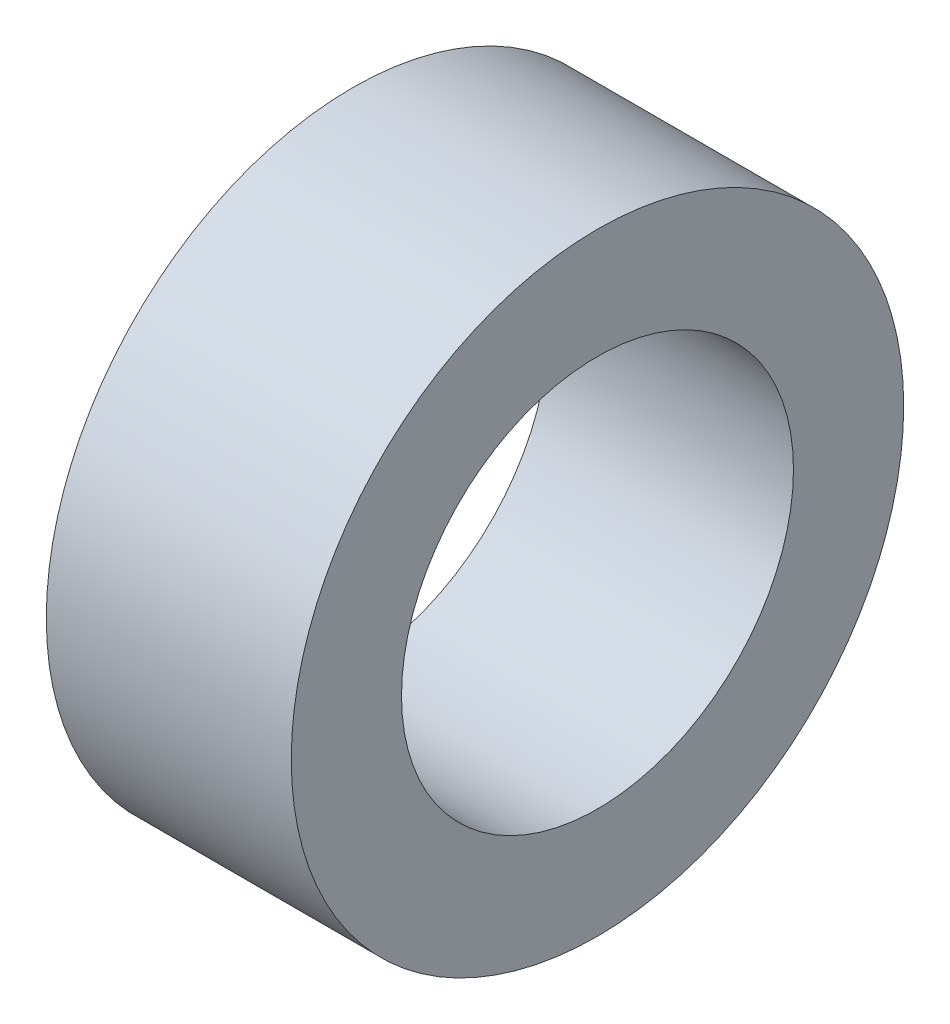
ISO-10303-21;
HEADER;
FILE_DESCRIPTION(('STEP AP214'),'2;1');
FILE_NAME('part.step','',(''),(''),'','','');
FILE_SCHEMA(('AUTOMOTIVE_DESIGN { 1 0 10303 214 1 1 1 1 }'));
ENDSEC;
DATA;
#1=APPLICATION_CONTEXT('core data for automotive mechanical design processes');
#2=APPLICATION_PROTOCOL_DEFINITION('international standard','automotive_design',2000,#1);
#3=PRODUCT_CONTEXT('',#1,'mechanical');
#4=PRODUCT('Part','Part','',(#3));
#5=PRODUCT_RELATED_PRODUCT_CATEGORY('part','',(#4));
#6=PRODUCT_DEFINITION_FORMATION('','',#4);
#7=PRODUCT_DEFINITION_CONTEXT('part definition',#1,'design');
#8=PRODUCT_DEFINITION('design','',#6,#7);
#9=PRODUCT_DEFINITION_SHAPE('','',#8);
#10=(LENGTH_UNIT() NAMED_UNIT(*) SI_UNIT(.MILLI.,.METRE.));
#11=(NAMED_UNIT(*) PLANE_ANGLE_UNIT() SI_UNIT($,.RADIAN.));
#12=(NAMED_UNIT(*) SI_UNIT($,.STERADIAN.) SOLID_ANGLE_UNIT());
#13=UNCERTAINTY_MEASURE_WITH_UNIT(LENGTH_MEASURE(1.E-05),#10,'distance_accuracy_value','');
#14=(GEOMETRIC_REPRESENTATION_CONTEXT(3) GLOBAL_UNCERTAINTY_ASSIGNED_CONTEXT((#13)) GLOBAL_UNIT_ASSIGNED_CONTEXT((#10,
#11,#12)) REPRESENTATION_CONTEXT('',''));
#15=CARTESIAN_POINT('',(0.,0.,0.));
#16=DIRECTION('',(0.,0.,1.));
#17=DIRECTION('',(1.,0.,0.));
#18=AXIS2_PLACEMENT_3D('',#15,#16,#17);
#19=CARTESIAN_POINT('',(2.,0.,0.));
#20=DIRECTION('',(1.,0.,0.));
#21=DIRECTION('',(0.,0.,-1.));
#22=AXIS2_PLACEMENT_3D('',#19,#20,#21);
#23=PLANE('',#22);
#24=CARTESIAN_POINT('',(2.,0.,0.));
#25=DIRECTION('',(1.,0.,0.));
#26=DIRECTION('',(0.,0.,-1.));
#27=AXIS2_PLACEMENT_3D('',#24,#25,#26);
#28=CIRCLE('',#27,2.5);
#29=CARTESIAN_POINT('',(2.,0.,-2.5));
#30=VERTEX_POINT('',#29);
#31=EDGE_CURVE('E10',#30,#30,#28,.T.);
#32=ORIENTED_EDGE('',*,*,#31,.T.);
#33=EDGE_LOOP('',(#32));
#34=FACE_BOUND('',#33,.T.);
#35=CARTESIAN_POINT('',(2.,0.,0.));
#36=DIRECTION('',(1.,0.,0.));
#37=DIRECTION('',(0.,0.,-1.));
#38=AXIS2_PLACEMENT_3D('',#35,#36,#37);
#39=CIRCLE('',#38,1.6);
#40=CARTESIAN_POINT('',(2.,0.,-1.6));
#41=VERTEX_POINT('',#40);
#42=EDGE_CURVE('E50',#41,#41,#39,.T.);
#43=ORIENTED_EDGE('',*,*,#42,.F.);
#44=EDGE_LOOP('',(#43));
#45=FACE_BOUND('',#44,.T.);
#46=ADVANCED_FACE('F37',(#34,#45),#23,.T.);
#47=CARTESIAN_POINT('',(0.,0.,0.));
#48=DIRECTION('',(1.,0.,0.));
#49=DIRECTION('',(0.,0.,-1.));
#50=AXIS2_PLACEMENT_3D('',#47,#48,#49);
#51=PLANE('',#50);
#52=CARTESIAN_POINT('',(0.,0.,0.));
#53=DIRECTION('',(1.,0.,0.));
#54=DIRECTION('',(0.,0.,-1.));
#55=AXIS2_PLACEMENT_3D('',#52,#53,#54);
#56=CIRCLE('',#55,2.5);
#57=CARTESIAN_POINT('',(0.,0.,-2.5));
#58=VERTEX_POINT('',#57);
#59=EDGE_CURVE('E41',#58,#58,#56,.T.);
#60=ORIENTED_EDGE('',*,*,#59,.F.);
#61=EDGE_LOOP('',(#60));
#62=FACE_BOUND('',#61,.T.);
#63=CARTESIAN_POINT('',(0.,0.,0.));
#64=DIRECTION('',(1.,0.,0.));
#65=DIRECTION('',(0.,0.,-1.));
#66=AXIS2_PLACEMENT_3D('',#63,#64,#65);
#67=CIRCLE('',#66,1.6);
#68=CARTESIAN_POINT('',(0.,0.,-1.6));
#69=VERTEX_POINT('',#68);
#70=EDGE_CURVE('E52',#69,#69,#67,.T.);
#71=ORIENTED_EDGE('',*,*,#70,.T.);
#72=EDGE_LOOP('',(#71));
#73=FACE_BOUND('',#72,.T.);
#74=ADVANCED_FACE('F64',(#62,#73),#51,.F.);
#75=CARTESIAN_POINT('',(2.,0.,0.));
#76=DIRECTION('',(-1.,0.,0.));
#77=DIRECTION('',(0.,0.,1.));
#78=AXIS2_PLACEMENT_3D('',#75,#76,#77);
#79=CYLINDRICAL_SURFACE('',#78,2.5);
#80=ORIENTED_EDGE('',*,*,#31,.F.);
#81=EDGE_LOOP('',(#80));
#82=FACE_BOUND('',#81,.T.);
#83=ORIENTED_EDGE('',*,*,#59,.T.);
#84=EDGE_LOOP('',(#83));
#85=FACE_BOUND('',#84,.T.);
#86=ADVANCED_FACE('F39',(#82,#85),#79,.T.);
#87=CARTESIAN_POINT('',(2.,0.,0.));
#88=DIRECTION('',(-1.,0.,0.));
#89=DIRECTION('',(0.,0.,1.));
#90=AXIS2_PLACEMENT_3D('',#87,#88,#89);
#91=CYLINDRICAL_SURFACE('',#90,1.6);
#92=ORIENTED_EDGE('',*,*,#42,.T.);
#93=EDGE_LOOP('',(#92));
#94=FACE_BOUND('',#93,.T.);
#95=ORIENTED_EDGE('',*,*,#70,.F.);
#96=EDGE_LOOP('',(#95));
#97=FACE_BOUND('',#96,.T.);
#98=ADVANCED_FACE('F60',(#94,#97),#91,.F.);
#99=CLOSED_SHELL('',(#46,#74,#86,#98));
#100=MANIFOLD_SOLID_BREP('B2',#99);
#101=ADVANCED_BREP_SHAPE_REPRESENTATION('',(#18,#100),#14);
#102=SHAPE_DEFINITION_REPRESENTATION(#9,#101);
ENDSEC;
END-ISO-10303-21;
